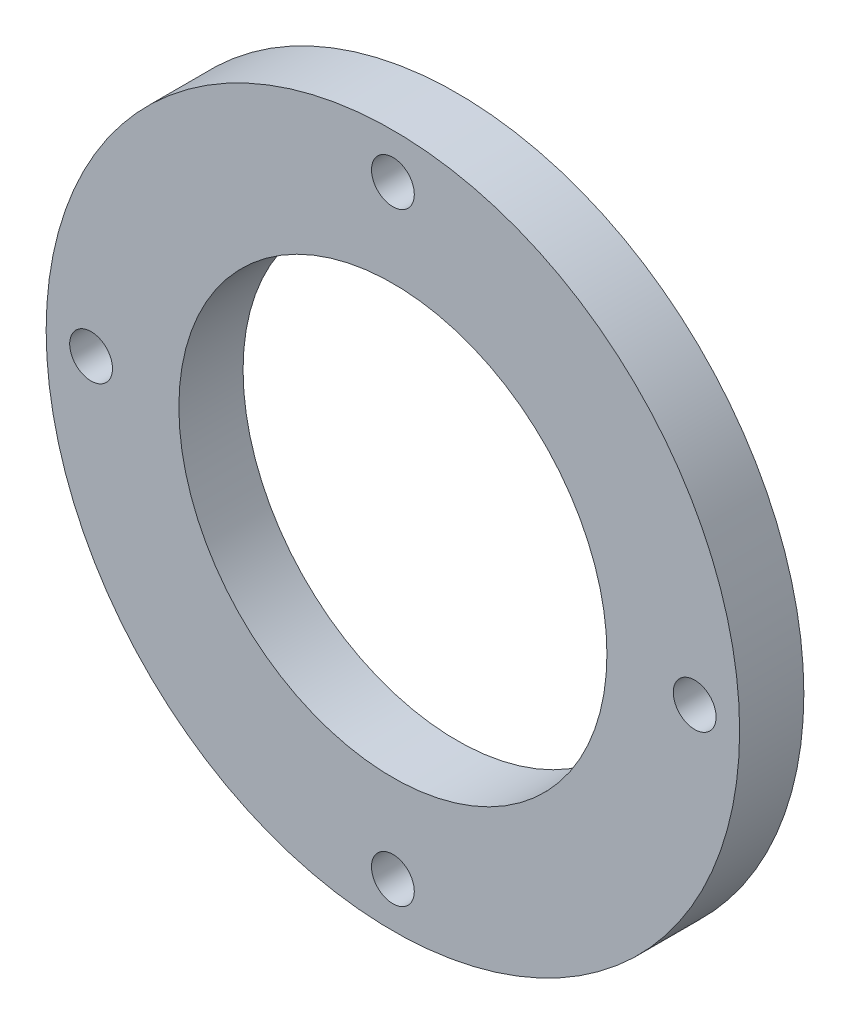
ISO-10303-21;
HEADER;
FILE_DESCRIPTION(('STEP AP214'),'2;1');
FILE_NAME('part.step','',(''),(''),'','','');
FILE_SCHEMA(('AUTOMOTIVE_DESIGN { 1 0 10303 214 1 1 1 1 }'));
ENDSEC;
DATA;
#1=APPLICATION_CONTEXT('core data for automotive mechanical design processes');
#2=APPLICATION_PROTOCOL_DEFINITION('international standard','automotive_design',2000,#1);
#3=PRODUCT_CONTEXT('',#1,'mechanical');
#4=PRODUCT('Part','Part','',(#3));
#5=PRODUCT_RELATED_PRODUCT_CATEGORY('part','',(#4));
#6=PRODUCT_DEFINITION_FORMATION('','',#4);
#7=PRODUCT_DEFINITION_CONTEXT('part definition',#1,'design');
#8=PRODUCT_DEFINITION('design','',#6,#7);
#9=PRODUCT_DEFINITION_SHAPE('','',#8);
#10=(LENGTH_UNIT() NAMED_UNIT(*) SI_UNIT(.MILLI.,.METRE.));
#11=(NAMED_UNIT(*) PLANE_ANGLE_UNIT() SI_UNIT($,.RADIAN.));
#12=(NAMED_UNIT(*) SI_UNIT($,.STERADIAN.) SOLID_ANGLE_UNIT());
#13=UNCERTAINTY_MEASURE_WITH_UNIT(LENGTH_MEASURE(1.E-05),#10,'distance_accuracy_value','');
#14=(GEOMETRIC_REPRESENTATION_CONTEXT(3) GLOBAL_UNCERTAINTY_ASSIGNED_CONTEXT((#13)) GLOBAL_UNIT_ASSIGNED_CONTEXT((#10,
#11,#12)) REPRESENTATION_CONTEXT('',''));
#15=CARTESIAN_POINT('',(0.,0.,0.));
#16=DIRECTION('',(0.,0.,1.));
#17=DIRECTION('',(1.,0.,0.));
#18=AXIS2_PLACEMENT_3D('',#15,#16,#17);
#19=CARTESIAN_POINT('',(0.,0.,15.));
#20=DIRECTION('',(0.,0.,1.));
#21=DIRECTION('',(1.,0.,0.));
#22=AXIS2_PLACEMENT_3D('',#19,#20,#21);
#23=PLANE('',#22);
#24=CARTESIAN_POINT('',(0.,70.5,15.));
#25=DIRECTION('',(0.,0.,1.));
#26=DIRECTION('',(1.,0.,0.));
#27=AXIS2_PLACEMENT_3D('',#24,#25,#26);
#28=CIRCLE('',#27,5.);
#29=CARTESIAN_POINT('',(5.,70.5,15.));
#30=VERTEX_POINT('',#29);
#31=EDGE_CURVE('E87',#30,#30,#28,.T.);
#32=ORIENTED_EDGE('',*,*,#31,.F.);
#33=EDGE_LOOP('',(#32));
#34=FACE_BOUND('',#33,.T.);
#35=CARTESIAN_POINT('',(-70.5,0.,15.));
#36=DIRECTION('',(0.,0.,1.));
#37=DIRECTION('',(1.,0.,0.));
#38=AXIS2_PLACEMENT_3D('',#35,#36,#37);
#39=CIRCLE('',#38,5.);
#40=CARTESIAN_POINT('',(-65.5,0.,15.));
#41=VERTEX_POINT('',#40);
#42=EDGE_CURVE('E79',#41,#41,#39,.T.);
#43=ORIENTED_EDGE('',*,*,#42,.F.);
#44=EDGE_LOOP('',(#43));
#45=FACE_BOUND('',#44,.T.);
#46=CARTESIAN_POINT('',(70.5,0.,15.));
#47=DIRECTION('',(0.,0.,1.));
#48=DIRECTION('',(1.,0.,0.));
#49=AXIS2_PLACEMENT_3D('',#46,#47,#48);
#50=CIRCLE('',#49,5.);
#51=CARTESIAN_POINT('',(75.5,0.,15.));
#52=VERTEX_POINT('',#51);
#53=EDGE_CURVE('E70',#52,#52,#50,.T.);
#54=ORIENTED_EDGE('',*,*,#53,.F.);
#55=EDGE_LOOP('',(#54));
#56=FACE_BOUND('',#55,.T.);
#57=CARTESIAN_POINT('',(0.,-70.5000000000001,15.));
#58=DIRECTION('',(0.,0.,1.));
#59=DIRECTION('',(1.,0.,0.));
#60=AXIS2_PLACEMENT_3D('',#57,#58,#59);
#61=CIRCLE('',#60,5.);
#62=CARTESIAN_POINT('',(5.,-70.5000000000001,15.));
#63=VERTEX_POINT('',#62);
#64=EDGE_CURVE('E71',#63,#63,#61,.T.);
#65=ORIENTED_EDGE('',*,*,#64,.F.);
#66=EDGE_LOOP('',(#65));
#67=FACE_BOUND('',#66,.T.);
#68=CARTESIAN_POINT('',(0.,0.,15.));
#69=DIRECTION('',(0.,0.,1.));
#70=DIRECTION('',(1.,0.,0.));
#71=AXIS2_PLACEMENT_3D('',#68,#69,#70);
#72=CIRCLE('',#71,81.);
#73=CARTESIAN_POINT('',(81.,0.,15.));
#74=VERTEX_POINT('',#73);
#75=EDGE_CURVE('E10',#74,#74,#72,.T.);
#76=ORIENTED_EDGE('',*,*,#75,.T.);
#77=EDGE_LOOP('',(#76));
#78=FACE_BOUND('',#77,.T.);
#79=CARTESIAN_POINT('',(0.,0.,15.));
#80=DIRECTION('',(0.,0.,1.));
#81=DIRECTION('',(1.,0.,0.));
#82=AXIS2_PLACEMENT_3D('',#79,#80,#81);
#83=CIRCLE('',#82,50.);
#84=CARTESIAN_POINT('',(50.,0.,15.));
#85=VERTEX_POINT('',#84);
#86=EDGE_CURVE('E56',#85,#85,#83,.T.);
#87=ORIENTED_EDGE('',*,*,#86,.F.);
#88=EDGE_LOOP('',(#87));
#89=FACE_BOUND('',#88,.T.);
#90=ADVANCED_FACE('F43',(#34,#45,#56,#67,#78,#89),#23,.T.);
#91=CARTESIAN_POINT('',(0.,0.,0.));
#92=DIRECTION('',(0.,0.,1.));
#93=DIRECTION('',(1.,0.,0.));
#94=AXIS2_PLACEMENT_3D('',#91,#92,#93);
#95=PLANE('',#94);
#96=CARTESIAN_POINT('',(0.,70.5,0.));
#97=DIRECTION('',(0.,0.,1.));
#98=DIRECTION('',(1.,0.,0.));
#99=AXIS2_PLACEMENT_3D('',#96,#97,#98);
#100=CIRCLE('',#99,5.);
#101=CARTESIAN_POINT('',(5.,70.5,0.));
#102=VERTEX_POINT('',#101);
#103=EDGE_CURVE('E62',#102,#102,#100,.F.);
#104=ORIENTED_EDGE('',*,*,#103,.F.);
#105=EDGE_LOOP('',(#104));
#106=FACE_BOUND('',#105,.T.);
#107=CARTESIAN_POINT('',(-70.5,0.,0.));
#108=DIRECTION('',(0.,0.,1.));
#109=DIRECTION('',(1.,0.,0.));
#110=AXIS2_PLACEMENT_3D('',#107,#108,#109);
#111=CIRCLE('',#110,5.);
#112=CARTESIAN_POINT('',(-65.5,0.,0.));
#113=VERTEX_POINT('',#112);
#114=EDGE_CURVE('E83',#113,#113,#111,.F.);
#115=ORIENTED_EDGE('',*,*,#114,.F.);
#116=EDGE_LOOP('',(#115));
#117=FACE_BOUND('',#116,.T.);
#118=CARTESIAN_POINT('',(70.5,0.,0.));
#119=DIRECTION('',(0.,0.,1.));
#120=DIRECTION('',(1.,0.,0.));
#121=AXIS2_PLACEMENT_3D('',#118,#119,#120);
#122=CIRCLE('',#121,5.);
#123=CARTESIAN_POINT('',(75.5,0.,0.));
#124=VERTEX_POINT('',#123);
#125=EDGE_CURVE('E75',#124,#124,#122,.F.);
#126=ORIENTED_EDGE('',*,*,#125,.F.);
#127=EDGE_LOOP('',(#126));
#128=FACE_BOUND('',#127,.T.);
#129=CARTESIAN_POINT('',(0.,-70.5000000000001,0.));
#130=DIRECTION('',(0.,0.,1.));
#131=DIRECTION('',(1.,0.,0.));
#132=AXIS2_PLACEMENT_3D('',#129,#130,#131);
#133=CIRCLE('',#132,5.);
#134=CARTESIAN_POINT('',(5.,-70.5000000000001,0.));
#135=VERTEX_POINT('',#134);
#136=EDGE_CURVE('E66',#135,#135,#133,.F.);
#137=ORIENTED_EDGE('',*,*,#136,.F.);
#138=EDGE_LOOP('',(#137));
#139=FACE_BOUND('',#138,.T.);
#140=CARTESIAN_POINT('',(0.,0.,0.));
#141=DIRECTION('',(0.,0.,1.));
#142=DIRECTION('',(1.,0.,0.));
#143=AXIS2_PLACEMENT_3D('',#140,#141,#142);
#144=CIRCLE('',#143,81.);
#145=CARTESIAN_POINT('',(81.,0.,0.));
#146=VERTEX_POINT('',#145);
#147=EDGE_CURVE('E47',#146,#146,#144,.T.);
#148=ORIENTED_EDGE('',*,*,#147,.F.);
#149=EDGE_LOOP('',(#148));
#150=FACE_BOUND('',#149,.T.);
#151=CARTESIAN_POINT('',(0.,0.,0.));
#152=DIRECTION('',(0.,0.,1.));
#153=DIRECTION('',(1.,0.,0.));
#154=AXIS2_PLACEMENT_3D('',#151,#152,#153);
#155=CIRCLE('',#154,50.);
#156=CARTESIAN_POINT('',(50.,0.,0.));
#157=VERTEX_POINT('',#156);
#158=EDGE_CURVE('E58',#157,#157,#155,.T.);
#159=ORIENTED_EDGE('',*,*,#158,.T.);
#160=EDGE_LOOP('',(#159));
#161=FACE_BOUND('',#160,.T.);
#162=ADVANCED_FACE('F102',(#106,#117,#128,#139,#150,#161),#95,.F.);
#163=CARTESIAN_POINT('',(0.,0.,15.));
#164=DIRECTION('',(0.,0.,-1.));
#165=DIRECTION('',(-1.,0.,0.));
#166=AXIS2_PLACEMENT_3D('',#163,#164,#165);
#167=CYLINDRICAL_SURFACE('',#166,81.);
#168=ORIENTED_EDGE('',*,*,#75,.F.);
#169=EDGE_LOOP('',(#168));
#170=FACE_BOUND('',#169,.T.);
#171=ORIENTED_EDGE('',*,*,#147,.T.);
#172=EDGE_LOOP('',(#171));
#173=FACE_BOUND('',#172,.T.);
#174=ADVANCED_FACE('F45',(#170,#173),#167,.T.);
#175=CARTESIAN_POINT('',(0.,0.,15.));
#176=DIRECTION('',(0.,0.,-1.));
#177=DIRECTION('',(-1.,0.,0.));
#178=AXIS2_PLACEMENT_3D('',#175,#176,#177);
#179=CYLINDRICAL_SURFACE('',#178,50.);
#180=ORIENTED_EDGE('',*,*,#86,.T.);
#181=EDGE_LOOP('',(#180));
#182=FACE_BOUND('',#181,.T.);
#183=ORIENTED_EDGE('',*,*,#158,.F.);
#184=EDGE_LOOP('',(#183));
#185=FACE_BOUND('',#184,.T.);
#186=ADVANCED_FACE('F112',(#182,#185),#179,.F.);
#187=CARTESIAN_POINT('',(0.,-70.5000000000001,-14.142135623731));
#188=DIRECTION('',(0.,0.,1.));
#189=DIRECTION('',(1.,0.,0.));
#190=AXIS2_PLACEMENT_3D('',#187,#188,#189);
#191=CYLINDRICAL_SURFACE('',#190,5.);
#192=ORIENTED_EDGE('',*,*,#136,.T.);
#193=EDGE_LOOP('',(#192));
#194=FACE_BOUND('',#193,.T.);
#195=ORIENTED_EDGE('',*,*,#64,.T.);
#196=EDGE_LOOP('',(#195));
#197=FACE_BOUND('',#196,.T.);
#198=ADVANCED_FACE('F115',(#194,#197),#191,.F.);
#199=CARTESIAN_POINT('',(70.5,0.,-14.142135623731));
#200=DIRECTION('',(0.,0.,1.));
#201=DIRECTION('',(1.,0.,0.));
#202=AXIS2_PLACEMENT_3D('',#199,#200,#201);
#203=CYLINDRICAL_SURFACE('',#202,5.);
#204=ORIENTED_EDGE('',*,*,#125,.T.);
#205=EDGE_LOOP('',(#204));
#206=FACE_BOUND('',#205,.T.);
#207=ORIENTED_EDGE('',*,*,#53,.T.);
#208=EDGE_LOOP('',(#207));
#209=FACE_BOUND('',#208,.T.);
#210=ADVANCED_FACE('F130',(#206,#209),#203,.F.);
#211=CARTESIAN_POINT('',(-70.5,0.,-14.142135623731));
#212=DIRECTION('',(0.,0.,1.));
#213=DIRECTION('',(1.,0.,0.));
#214=AXIS2_PLACEMENT_3D('',#211,#212,#213);
#215=CYLINDRICAL_SURFACE('',#214,5.);
#216=ORIENTED_EDGE('',*,*,#114,.T.);
#217=EDGE_LOOP('',(#216));
#218=FACE_BOUND('',#217,.T.);
#219=ORIENTED_EDGE('',*,*,#42,.T.);
#220=EDGE_LOOP('',(#219));
#221=FACE_BOUND('',#220,.T.);
#222=ADVANCED_FACE('F134',(#218,#221),#215,.F.);
#223=CARTESIAN_POINT('',(0.,70.5,-14.142135623731));
#224=DIRECTION('',(0.,0.,1.));
#225=DIRECTION('',(1.,0.,0.));
#226=AXIS2_PLACEMENT_3D('',#223,#224,#225);
#227=CYLINDRICAL_SURFACE('',#226,5.);
#228=ORIENTED_EDGE('',*,*,#103,.T.);
#229=EDGE_LOOP('',(#228));
#230=FACE_BOUND('',#229,.T.);
#231=ORIENTED_EDGE('',*,*,#31,.T.);
#232=EDGE_LOOP('',(#231));
#233=FACE_BOUND('',#232,.T.);
#234=ADVANCED_FACE('F98',(#230,#233),#227,.F.);
#235=CLOSED_SHELL('',(#90,#162,#174,#186,#198,#210,#222,#234));
#236=MANIFOLD_SOLID_BREP('B2',#235);
#237=ADVANCED_BREP_SHAPE_REPRESENTATION('',(#18,#236),#14);
#238=SHAPE_DEFINITION_REPRESENTATION(#9,#237);
ENDSEC;
END-ISO-10303-21;
